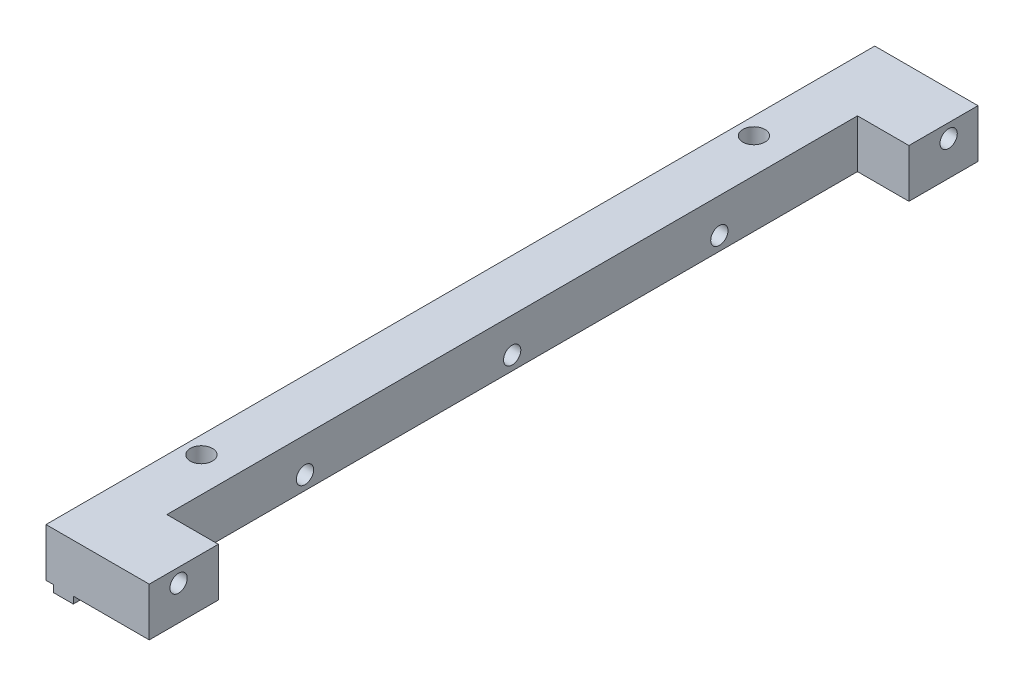
ISO-10303-21;
HEADER;
FILE_DESCRIPTION(('STEP AP214'),'2;1');
FILE_NAME('part.step','',(''),(''),'','','');
FILE_SCHEMA(('AUTOMOTIVE_DESIGN { 1 0 10303 214 1 1 1 1 }'));
ENDSEC;
DATA;
#1=APPLICATION_CONTEXT('core data for automotive mechanical design processes');
#2=APPLICATION_PROTOCOL_DEFINITION('international standard','automotive_design',2000,#1);
#3=PRODUCT_CONTEXT('',#1,'mechanical');
#4=PRODUCT('Part','Part','',(#3));
#5=PRODUCT_RELATED_PRODUCT_CATEGORY('part','',(#4));
#6=PRODUCT_DEFINITION_FORMATION('','',#4);
#7=PRODUCT_DEFINITION_CONTEXT('part definition',#1,'design');
#8=PRODUCT_DEFINITION('design','',#6,#7);
#9=PRODUCT_DEFINITION_SHAPE('','',#8);
#10=(LENGTH_UNIT() NAMED_UNIT(*) SI_UNIT(.MILLI.,.METRE.));
#11=(NAMED_UNIT(*) PLANE_ANGLE_UNIT() SI_UNIT($,.RADIAN.));
#12=(NAMED_UNIT(*) SI_UNIT($,.STERADIAN.) SOLID_ANGLE_UNIT());
#13=UNCERTAINTY_MEASURE_WITH_UNIT(LENGTH_MEASURE(1.E-05),#10,'distance_accuracy_value','');
#14=(GEOMETRIC_REPRESENTATION_CONTEXT(3) GLOBAL_UNCERTAINTY_ASSIGNED_CONTEXT((#13)) GLOBAL_UNIT_ASSIGNED_CONTEXT((#10,
#11,#12)) REPRESENTATION_CONTEXT('',''));
#15=CARTESIAN_POINT('',(0.,0.,0.));
#16=DIRECTION('',(0.,0.,1.));
#17=DIRECTION('',(1.,0.,0.));
#18=AXIS2_PLACEMENT_3D('',#15,#16,#17);
#19=CARTESIAN_POINT('',(14.95,7.,120.));
#20=DIRECTION('',(-1.,0.,0.));
#21=DIRECTION('',(0.,0.,1.));
#22=AXIS2_PLACEMENT_3D('',#19,#20,#21);
#23=PLANE('',#22);
#24=CARTESIAN_POINT('',(14.95,5.,4.25));
#25=DIRECTION('',(1.,0.,0.));
#26=DIRECTION('',(0.,0.,-1.));
#27=AXIS2_PLACEMENT_3D('',#24,#25,#26);
#28=CIRCLE('',#27,1.25);
#29=CARTESIAN_POINT('',(14.95,5.,3.));
#30=VERTEX_POINT('',#29);
#31=EDGE_CURVE('E249',#30,#30,#28,.T.);
#32=ORIENTED_EDGE('',*,*,#31,.F.);
#33=EDGE_LOOP('',(#32));
#34=FACE_BOUND('',#33,.T.);
#35=DIRECTION('',(0.,0.,-1.));
#36=VECTOR('',#35,1.);
#37=CARTESIAN_POINT('',(14.95,7.,120.));
#38=LINE('',#37,#36);
#39=CARTESIAN_POINT('',(14.95,7.,10.));
#40=VERTEX_POINT('',#39);
#41=CARTESIAN_POINT('',(14.95,7.,0.));
#42=VERTEX_POINT('',#41);
#43=EDGE_CURVE('E300',#40,#42,#38,.T.);
#44=ORIENTED_EDGE('',*,*,#43,.F.);
#45=DIRECTION('',(0.,1.,0.));
#46=VECTOR('',#45,1.);
#47=CARTESIAN_POINT('',(14.95,0.,9.99999999999999));
#48=LINE('',#47,#46);
#49=CARTESIAN_POINT('',(14.95,0.,9.99999999999999));
#50=VERTEX_POINT('',#49);
#51=EDGE_CURVE('E327',#50,#40,#48,.T.);
#52=ORIENTED_EDGE('',*,*,#51,.F.);
#53=DIRECTION('',(0.,0.,-1.));
#54=VECTOR('',#53,1.);
#55=CARTESIAN_POINT('',(14.95,0.,120.));
#56=LINE('',#55,#54);
#57=CARTESIAN_POINT('',(14.95,0.,0.));
#58=VERTEX_POINT('',#57);
#59=EDGE_CURVE('E302',#50,#58,#56,.T.);
#60=ORIENTED_EDGE('',*,*,#59,.T.);
#61=DIRECTION('',(0.,1.,0.));
#62=VECTOR('',#61,1.);
#63=CARTESIAN_POINT('',(14.95,7.,0.));
#64=LINE('',#63,#62);
#65=EDGE_CURVE('E294',#58,#42,#64,.T.);
#66=ORIENTED_EDGE('',*,*,#65,.T.);
#67=EDGE_LOOP('',(#44,#52,#60,#66));
#68=FACE_BOUND('',#67,.T.);
#69=ADVANCED_FACE('F33',(#34,#68),#23,.F.);
#70=CARTESIAN_POINT('',(3.95,0.,120.));
#71=DIRECTION('',(-1.,0.,0.));
#72=DIRECTION('',(0.,0.,1.));
#73=AXIS2_PLACEMENT_3D('',#70,#71,#72);
#74=PLANE('',#73);
#75=DIRECTION('',(0.,0.,-1.));
#76=VECTOR('',#75,1.);
#77=CARTESIAN_POINT('',(3.95,0.,120.));
#78=LINE('',#77,#76);
#79=CARTESIAN_POINT('',(3.95,0.,19.3236125370766));
#80=VERTEX_POINT('',#79);
#81=CARTESIAN_POINT('',(3.95,0.,0.));
#82=VERTEX_POINT('',#81);
#83=EDGE_CURVE('E306',#80,#82,#78,.T.);
#84=ORIENTED_EDGE('',*,*,#83,.F.);
#85=DIRECTION('',(0.,-1.,0.));
#86=VECTOR('',#85,1.);
#87=CARTESIAN_POINT('',(3.95,7.,19.3236125370766));
#88=LINE('',#87,#86);
#89=CARTESIAN_POINT('',(3.95,-1.,19.3236125370766));
#90=VERTEX_POINT('',#89);
#91=EDGE_CURVE('E58',#80,#90,#88,.T.);
#92=ORIENTED_EDGE('',*,*,#91,.T.);
#93=DIRECTION('',(0.,0.,-1.));
#94=VECTOR('',#93,1.);
#95=CARTESIAN_POINT('',(3.95,-1.,120.));
#96=LINE('',#95,#94);
#97=CARTESIAN_POINT('',(3.95,-1.,0.));
#98=VERTEX_POINT('',#97);
#99=EDGE_CURVE('E310',#90,#98,#96,.T.);
#100=ORIENTED_EDGE('',*,*,#99,.T.);
#101=DIRECTION('',(0.,1.,0.));
#102=VECTOR('',#101,1.);
#103=CARTESIAN_POINT('',(3.95,0.,0.));
#104=LINE('',#103,#102);
#105=EDGE_CURVE('E288',#98,#82,#104,.T.);
#106=ORIENTED_EDGE('',*,*,#105,.T.);
#107=EDGE_LOOP('',(#84,#92,#100,#106));
#108=FACE_BOUND('',#107,.T.);
#109=ADVANCED_FACE('F423',(#108),#74,.F.);
#110=CARTESIAN_POINT('',(1.05,-1.,120.));
#111=DIRECTION('',(1.,0.,0.));
#112=DIRECTION('',(0.,0.,-1.));
#113=AXIS2_PLACEMENT_3D('',#110,#111,#112);
#114=PLANE('',#113);
#115=DIRECTION('',(0.,0.,-1.));
#116=VECTOR('',#115,1.);
#117=CARTESIAN_POINT('',(1.05,0.,120.));
#118=LINE('',#117,#116);
#119=CARTESIAN_POINT('',(1.05,0.,99.3236125370766));
#120=VERTEX_POINT('',#119);
#121=CARTESIAN_POINT('',(1.05,0.,20.6763874629234));
#122=VERTEX_POINT('',#121);
#123=EDGE_CURVE('E323',#120,#122,#118,.T.);
#124=ORIENTED_EDGE('',*,*,#123,.T.);
#125=DIRECTION('',(0.,-1.,0.));
#126=VECTOR('',#125,1.);
#127=CARTESIAN_POINT('',(1.05,7.,20.6763874629234));
#128=LINE('',#127,#126);
#129=CARTESIAN_POINT('',(1.05,-1.,20.6763874629234));
#130=VERTEX_POINT('',#129);
#131=EDGE_CURVE('E218',#122,#130,#128,.T.);
#132=ORIENTED_EDGE('',*,*,#131,.T.);
#133=DIRECTION('',(0.,0.,-1.));
#134=VECTOR('',#133,1.);
#135=CARTESIAN_POINT('',(1.05,-1.,120.));
#136=LINE('',#135,#134);
#137=CARTESIAN_POINT('',(1.05,-1.,99.3236125370766));
#138=VERTEX_POINT('',#137);
#139=EDGE_CURVE('E321',#138,#130,#136,.T.);
#140=ORIENTED_EDGE('',*,*,#139,.F.);
#141=DIRECTION('',(0.,-1.,0.));
#142=VECTOR('',#141,1.);
#143=CARTESIAN_POINT('',(1.05,7.,99.3236125370766));
#144=LINE('',#143,#142);
#145=EDGE_CURVE('E236',#138,#120,#144,.F.);
#146=ORIENTED_EDGE('',*,*,#145,.T.);
#147=EDGE_LOOP('',(#124,#132,#140,#146));
#148=FACE_BOUND('',#147,.T.);
#149=ADVANCED_FACE('F418',(#148),#114,.F.);
#150=CARTESIAN_POINT('',(3.95,-1.,120.));
#151=DIRECTION('',(0.,1.,0.));
#152=DIRECTION('',(-1.,0.,0.));
#153=AXIS2_PLACEMENT_3D('',#150,#151,#152);
#154=PLANE('',#153);
#155=ORIENTED_EDGE('',*,*,#139,.T.);
#156=CARTESIAN_POINT('',(2.5,-1.,20.));
#157=DIRECTION('',(0.,-1.,0.));
#158=DIRECTION('',(0.,0.,-1.));
#159=AXIS2_PLACEMENT_3D('',#156,#157,#158);
#160=CIRCLE('',#159,1.6);
#161=CARTESIAN_POINT('',(3.95,-1.,20.6763874629234));
#162=VERTEX_POINT('',#161);
#163=EDGE_CURVE('E204',#162,#130,#160,.T.);
#164=ORIENTED_EDGE('',*,*,#163,.F.);
#165=CARTESIAN_POINT('',(3.95,-1.,99.3236125370766));
#166=VERTEX_POINT('',#165);
#167=EDGE_CURVE('E316',#166,#162,#96,.T.);
#168=ORIENTED_EDGE('',*,*,#167,.F.);
#169=CARTESIAN_POINT('',(2.5,-1.,100.));
#170=DIRECTION('',(0.,-1.,0.));
#171=DIRECTION('',(0.,0.,-1.));
#172=AXIS2_PLACEMENT_3D('',#169,#170,#171);
#173=CIRCLE('',#172,1.6);
#174=EDGE_CURVE('E221',#138,#166,#173,.T.);
#175=ORIENTED_EDGE('',*,*,#174,.F.);
#176=EDGE_LOOP('',(#155,#164,#168,#175));
#177=FACE_BOUND('',#176,.T.);
#178=ADVANCED_FACE('F415',(#177),#154,.F.);
#179=CARTESIAN_POINT('',(1.05,0.,120.));
#180=VERTEX_POINT('',#179);
#181=CARTESIAN_POINT('',(1.05,0.,100.676387462923));
#182=VERTEX_POINT('',#181);
#183=EDGE_CURVE('E42',#180,#182,#118,.T.);
#184=ORIENTED_EDGE('',*,*,#183,.T.);
#185=DIRECTION('',(0.,-1.,0.));
#186=VECTOR('',#185,1.);
#187=CARTESIAN_POINT('',(1.05,7.,100.676387462923));
#188=LINE('',#187,#186);
#189=CARTESIAN_POINT('',(1.05,-1.,100.676387462923));
#190=VERTEX_POINT('',#189);
#191=EDGE_CURVE('E242',#182,#190,#188,.T.);
#192=ORIENTED_EDGE('',*,*,#191,.T.);
#193=CARTESIAN_POINT('',(1.05,-1.,120.));
#194=VERTEX_POINT('',#193);
#195=EDGE_CURVE('E317',#194,#190,#136,.T.);
#196=ORIENTED_EDGE('',*,*,#195,.F.);
#197=DIRECTION('',(0.,-1.,0.));
#198=VECTOR('',#197,1.);
#199=CARTESIAN_POINT('',(1.05,-1.,120.));
#200=LINE('',#199,#198);
#201=EDGE_CURVE('E264',#180,#194,#200,.T.);
#202=ORIENTED_EDGE('',*,*,#201,.F.);
#203=EDGE_LOOP('',(#184,#192,#196,#202));
#204=FACE_BOUND('',#203,.T.);
#205=ADVANCED_FACE('F394',(#204),#114,.F.);
#206=ORIENTED_EDGE('',*,*,#195,.T.);
#207=CARTESIAN_POINT('',(3.95,-1.,100.676387462923));
#208=VERTEX_POINT('',#207);
#209=EDGE_CURVE('E226',#208,#190,#173,.T.);
#210=ORIENTED_EDGE('',*,*,#209,.F.);
#211=CARTESIAN_POINT('',(3.95,-1.,120.));
#212=VERTEX_POINT('',#211);
#213=EDGE_CURVE('E312',#212,#208,#96,.T.);
#214=ORIENTED_EDGE('',*,*,#213,.F.);
#215=DIRECTION('',(1.,0.,0.));
#216=VECTOR('',#215,1.);
#217=CARTESIAN_POINT('',(3.95,-1.,120.));
#218=LINE('',#217,#216);
#219=EDGE_CURVE('E266',#194,#212,#218,.T.);
#220=ORIENTED_EDGE('',*,*,#219,.F.);
#221=EDGE_LOOP('',(#206,#210,#214,#220));
#222=FACE_BOUND('',#221,.T.);
#223=ADVANCED_FACE('F389',(#222),#154,.F.);
#224=ORIENTED_EDGE('',*,*,#167,.T.);
#225=DIRECTION('',(0.,-1.,0.));
#226=VECTOR('',#225,1.);
#227=CARTESIAN_POINT('',(3.95,7.,20.6763874629234));
#228=LINE('',#227,#226);
#229=CARTESIAN_POINT('',(3.95,0.,20.6763874629234));
#230=VERTEX_POINT('',#229);
#231=EDGE_CURVE('E208',#162,#230,#228,.F.);
#232=ORIENTED_EDGE('',*,*,#231,.T.);
#233=CARTESIAN_POINT('',(3.95,0.,99.3236125370766));
#234=VERTEX_POINT('',#233);
#235=EDGE_CURVE('E311',#234,#230,#78,.T.);
#236=ORIENTED_EDGE('',*,*,#235,.F.);
#237=DIRECTION('',(0.,-1.,0.));
#238=VECTOR('',#237,1.);
#239=CARTESIAN_POINT('',(3.95,7.,99.3236125370766));
#240=LINE('',#239,#238);
#241=EDGE_CURVE('E233',#234,#166,#240,.T.);
#242=ORIENTED_EDGE('',*,*,#241,.T.);
#243=EDGE_LOOP('',(#224,#232,#236,#242));
#244=FACE_BOUND('',#243,.T.);
#245=ADVANCED_FACE('F421',(#244),#74,.F.);
#246=CARTESIAN_POINT('',(0.,0.,120.));
#247=DIRECTION('',(1.,0.,0.));
#248=DIRECTION('',(0.,0.,-1.));
#249=AXIS2_PLACEMENT_3D('',#246,#247,#248);
#250=PLANE('',#249);
#251=CARTESIAN_POINT('',(0.,2.00000000000001,30.));
#252=DIRECTION('',(-1.,0.,0.));
#253=DIRECTION('',(0.,0.,1.));
#254=AXIS2_PLACEMENT_3D('',#251,#252,#253);
#255=CIRCLE('',#254,1.25);
#256=CARTESIAN_POINT('',(0.,2.00000000000001,31.25));
#257=VERTEX_POINT('',#256);
#258=EDGE_CURVE('E331',#257,#257,#255,.T.);
#259=ORIENTED_EDGE('',*,*,#258,.F.);
#260=EDGE_LOOP('',(#259));
#261=FACE_BOUND('',#260,.T.);
#262=CARTESIAN_POINT('',(0.,2.00000000000001,90.));
#263=DIRECTION('',(-1.,0.,0.));
#264=DIRECTION('',(0.,0.,1.));
#265=AXIS2_PLACEMENT_3D('',#262,#263,#264);
#266=CIRCLE('',#265,1.25);
#267=CARTESIAN_POINT('',(0.,2.00000000000001,91.25));
#268=VERTEX_POINT('',#267);
#269=EDGE_CURVE('E336',#268,#268,#266,.T.);
#270=ORIENTED_EDGE('',*,*,#269,.F.);
#271=EDGE_LOOP('',(#270));
#272=FACE_BOUND('',#271,.T.);
#273=CARTESIAN_POINT('',(0.,2.00000000000001,60.));
#274=DIRECTION('',(-1.,0.,0.));
#275=DIRECTION('',(0.,0.,1.));
#276=AXIS2_PLACEMENT_3D('',#273,#274,#275);
#277=CIRCLE('',#276,1.25);
#278=CARTESIAN_POINT('',(0.,2.00000000000001,61.25));
#279=VERTEX_POINT('',#278);
#280=EDGE_CURVE('E328',#279,#279,#277,.T.);
#281=ORIENTED_EDGE('',*,*,#280,.F.);
#282=EDGE_LOOP('',(#281));
#283=FACE_BOUND('',#282,.T.);
#284=CARTESIAN_POINT('',(0.,5.,115.75));
#285=DIRECTION('',(1.,0.,0.));
#286=DIRECTION('',(0.,0.,-1.));
#287=AXIS2_PLACEMENT_3D('',#284,#285,#286);
#288=CIRCLE('',#287,1.25);
#289=CARTESIAN_POINT('',(0.,5.,114.5));
#290=VERTEX_POINT('',#289);
#291=EDGE_CURVE('E246',#290,#290,#288,.T.);
#292=ORIENTED_EDGE('',*,*,#291,.T.);
#293=EDGE_LOOP('',(#292));
#294=FACE_BOUND('',#293,.T.);
#295=CARTESIAN_POINT('',(0.,5.,4.25));
#296=DIRECTION('',(1.,0.,0.));
#297=DIRECTION('',(0.,0.,-1.));
#298=AXIS2_PLACEMENT_3D('',#295,#296,#297);
#299=CIRCLE('',#298,1.25);
#300=CARTESIAN_POINT('',(0.,5.,3.));
#301=VERTEX_POINT('',#300);
#302=EDGE_CURVE('E252',#301,#301,#299,.T.);
#303=ORIENTED_EDGE('',*,*,#302,.T.);
#304=EDGE_LOOP('',(#303));
#305=FACE_BOUND('',#304,.T.);
#306=DIRECTION('',(0.,-1.,0.));
#307=VECTOR('',#306,1.);
#308=CARTESIAN_POINT('',(0.,0.,0.));
#309=LINE('',#308,#307);
#310=CARTESIAN_POINT('',(0.,7.,0.));
#311=VERTEX_POINT('',#310);
#312=CARTESIAN_POINT('',(0.,0.,0.));
#313=VERTEX_POINT('',#312);
#314=EDGE_CURVE('E255',#311,#313,#309,.T.);
#315=ORIENTED_EDGE('',*,*,#314,.T.);
#316=DIRECTION('',(0.,0.,-1.));
#317=VECTOR('',#316,1.);
#318=CARTESIAN_POINT('',(0.,0.,120.));
#319=LINE('',#318,#317);
#320=CARTESIAN_POINT('',(0.,0.,120.));
#321=VERTEX_POINT('',#320);
#322=EDGE_CURVE('E11',#321,#313,#319,.T.);
#323=ORIENTED_EDGE('',*,*,#322,.F.);
#324=DIRECTION('',(0.,-1.,0.));
#325=VECTOR('',#324,1.);
#326=CARTESIAN_POINT('',(0.,0.,120.));
#327=LINE('',#326,#325);
#328=CARTESIAN_POINT('',(0.,7.,120.));
#329=VERTEX_POINT('',#328);
#330=EDGE_CURVE('E258',#329,#321,#327,.T.);
#331=ORIENTED_EDGE('',*,*,#330,.F.);
#332=DIRECTION('',(0.,0.,-1.));
#333=VECTOR('',#332,1.);
#334=CARTESIAN_POINT('',(0.,7.,120.));
#335=LINE('',#334,#333);
#336=EDGE_CURVE('E276',#329,#311,#335,.T.);
#337=ORIENTED_EDGE('',*,*,#336,.T.);
#338=EDGE_LOOP('',(#315,#323,#331,#337));
#339=FACE_BOUND('',#338,.T.);
#340=ADVANCED_FACE('F35',(#261,#272,#283,#294,#305,#339),#250,.F.);
#341=CARTESIAN_POINT('',(1.05,0.,120.));
#342=DIRECTION('',(0.,1.,0.));
#343=DIRECTION('',(-1.,0.,0.));
#344=AXIS2_PLACEMENT_3D('',#341,#342,#343);
#345=PLANE('',#344);
#346=CARTESIAN_POINT('',(1.05,0.,19.3236125370766));
#347=VERTEX_POINT('',#346);
#348=CARTESIAN_POINT('',(1.05,0.,0.));
#349=VERTEX_POINT('',#348);
#350=EDGE_CURVE('E320',#347,#349,#118,.T.);
#351=ORIENTED_EDGE('',*,*,#350,.F.);
#352=CARTESIAN_POINT('',(2.5,0.,20.));
#353=DIRECTION('',(0.,1.,0.));
#354=DIRECTION('',(-1.,0.,0.));
#355=AXIS2_PLACEMENT_3D('',#352,#353,#354);
#356=CIRCLE('',#355,1.6);
#357=EDGE_CURVE('E215',#347,#122,#356,.T.);
#358=ORIENTED_EDGE('',*,*,#357,.T.);
#359=ORIENTED_EDGE('',*,*,#123,.F.);
#360=CARTESIAN_POINT('',(2.5,0.,100.));
#361=DIRECTION('',(0.,1.,0.));
#362=DIRECTION('',(-1.,0.,0.));
#363=AXIS2_PLACEMENT_3D('',#360,#361,#362);
#364=CIRCLE('',#363,1.6);
#365=EDGE_CURVE('E239',#120,#182,#364,.T.);
#366=ORIENTED_EDGE('',*,*,#365,.T.);
#367=ORIENTED_EDGE('',*,*,#183,.F.);
#368=DIRECTION('',(1.,0.,0.));
#369=VECTOR('',#368,1.);
#370=CARTESIAN_POINT('',(1.05,0.,120.));
#371=LINE('',#370,#369);
#372=EDGE_CURVE('E261',#321,#180,#371,.T.);
#373=ORIENTED_EDGE('',*,*,#372,.F.);
#374=ORIENTED_EDGE('',*,*,#322,.T.);
#375=DIRECTION('',(1.,0.,0.));
#376=VECTOR('',#375,1.);
#377=CARTESIAN_POINT('',(1.05,0.,0.));
#378=LINE('',#377,#376);
#379=EDGE_CURVE('E279',#313,#349,#378,.T.);
#380=ORIENTED_EDGE('',*,*,#379,.T.);
#381=EDGE_LOOP('',(#351,#358,#359,#366,#367,#373,#374,#380));
#382=FACE_BOUND('',#381,.T.);
#383=ADVANCED_FACE('F398',(#382),#345,.F.);
#384=CARTESIAN_POINT('',(1.05,-1.,19.3236125370766));
#385=VERTEX_POINT('',#384);
#386=CARTESIAN_POINT('',(1.05,-1.,0.));
#387=VERTEX_POINT('',#386);
#388=EDGE_CURVE('E315',#385,#387,#136,.T.);
#389=ORIENTED_EDGE('',*,*,#388,.F.);
#390=DIRECTION('',(0.,-1.,0.));
#391=VECTOR('',#390,1.);
#392=CARTESIAN_POINT('',(1.05,7.,19.3236125370766));
#393=LINE('',#392,#391);
#394=EDGE_CURVE('E212',#385,#347,#393,.F.);
#395=ORIENTED_EDGE('',*,*,#394,.T.);
#396=ORIENTED_EDGE('',*,*,#350,.T.);
#397=DIRECTION('',(0.,-1.,0.));
#398=VECTOR('',#397,1.);
#399=CARTESIAN_POINT('',(1.05,-1.,0.));
#400=LINE('',#399,#398);
#401=EDGE_CURVE('E282',#349,#387,#400,.T.);
#402=ORIENTED_EDGE('',*,*,#401,.T.);
#403=EDGE_LOOP('',(#389,#395,#396,#402));
#404=FACE_BOUND('',#403,.T.);
#405=ADVANCED_FACE('F403',(#404),#114,.F.);
#406=ORIENTED_EDGE('',*,*,#99,.F.);
#407=EDGE_CURVE('E205',#385,#90,#160,.T.);
#408=ORIENTED_EDGE('',*,*,#407,.F.);
#409=ORIENTED_EDGE('',*,*,#388,.T.);
#410=DIRECTION('',(1.,0.,0.));
#411=VECTOR('',#410,1.);
#412=CARTESIAN_POINT('',(3.95,-1.,0.));
#413=LINE('',#412,#411);
#414=EDGE_CURVE('E285',#387,#98,#413,.T.);
#415=ORIENTED_EDGE('',*,*,#414,.T.);
#416=EDGE_LOOP('',(#406,#408,#409,#415));
#417=FACE_BOUND('',#416,.T.);
#418=ADVANCED_FACE('F408',(#417),#154,.F.);
#419=ORIENTED_EDGE('',*,*,#213,.T.);
#420=DIRECTION('',(0.,-1.,0.));
#421=VECTOR('',#420,1.);
#422=CARTESIAN_POINT('',(3.95,7.,100.676387462923));
#423=LINE('',#422,#421);
#424=CARTESIAN_POINT('',(3.95,0.,100.676387462923));
#425=VERTEX_POINT('',#424);
#426=EDGE_CURVE('E230',#208,#425,#423,.F.);
#427=ORIENTED_EDGE('',*,*,#426,.T.);
#428=CARTESIAN_POINT('',(3.95,0.,120.));
#429=VERTEX_POINT('',#428);
#430=EDGE_CURVE('E307',#429,#425,#78,.T.);
#431=ORIENTED_EDGE('',*,*,#430,.F.);
#432=DIRECTION('',(0.,1.,0.));
#433=VECTOR('',#432,1.);
#434=CARTESIAN_POINT('',(3.95,0.,120.));
#435=LINE('',#434,#433);
#436=EDGE_CURVE('E268',#212,#429,#435,.T.);
#437=ORIENTED_EDGE('',*,*,#436,.F.);
#438=EDGE_LOOP('',(#419,#427,#431,#437));
#439=FACE_BOUND('',#438,.T.);
#440=ADVANCED_FACE('F383',(#439),#74,.F.);
#441=CARTESIAN_POINT('',(14.95,0.,120.));
#442=DIRECTION('',(0.,1.,0.));
#443=DIRECTION('',(-1.,0.,0.));
#444=AXIS2_PLACEMENT_3D('',#441,#442,#443);
#445=PLANE('',#444);
#446=ORIENTED_EDGE('',*,*,#59,.F.);
#447=DIRECTION('',(1.,0.,0.));
#448=VECTOR('',#447,1.);
#449=CARTESIAN_POINT('',(7.5,0.,9.99999999999999));
#450=LINE('',#449,#448);
#451=CARTESIAN_POINT('',(7.5,0.,9.99999999999999));
#452=VERTEX_POINT('',#451);
#453=EDGE_CURVE('E195',#452,#50,#450,.T.);
#454=ORIENTED_EDGE('',*,*,#453,.F.);
#455=DIRECTION('',(0.,0.,-1.));
#456=VECTOR('',#455,1.);
#457=CARTESIAN_POINT('',(7.5,0.,9.99999999999999));
#458=LINE('',#457,#456);
#459=CARTESIAN_POINT('',(7.5,0.,110.));
#460=VERTEX_POINT('',#459);
#461=EDGE_CURVE('E180',#460,#452,#458,.T.);
#462=ORIENTED_EDGE('',*,*,#461,.F.);
#463=DIRECTION('',(1.,0.,0.));
#464=VECTOR('',#463,1.);
#465=CARTESIAN_POINT('',(7.5,0.,110.));
#466=LINE('',#465,#464);
#467=CARTESIAN_POINT('',(14.95,0.,110.));
#468=VERTEX_POINT('',#467);
#469=EDGE_CURVE('E178',#460,#468,#466,.T.);
#470=ORIENTED_EDGE('',*,*,#469,.T.);
#471=CARTESIAN_POINT('',(14.95,0.,120.));
#472=VERTEX_POINT('',#471);
#473=EDGE_CURVE('E303',#472,#468,#56,.T.);
#474=ORIENTED_EDGE('',*,*,#473,.F.);
#475=DIRECTION('',(1.,0.,0.));
#476=VECTOR('',#475,1.);
#477=CARTESIAN_POINT('',(14.95,0.,120.));
#478=LINE('',#477,#476);
#479=EDGE_CURVE('E270',#429,#472,#478,.T.);
#480=ORIENTED_EDGE('',*,*,#479,.F.);
#481=ORIENTED_EDGE('',*,*,#430,.T.);
#482=CARTESIAN_POINT('',(2.5,0.,100.));
#483=DIRECTION('',(0.,1.,0.));
#484=DIRECTION('',(-1.,0.,0.));
#485=AXIS2_PLACEMENT_3D('',#482,#483,#484);
#486=CIRCLE('',#485,1.6);
#487=EDGE_CURVE('E225',#425,#234,#486,.T.);
#488=ORIENTED_EDGE('',*,*,#487,.T.);
#489=ORIENTED_EDGE('',*,*,#235,.T.);
#490=CARTESIAN_POINT('',(2.5,0.,20.));
#491=DIRECTION('',(0.,1.,0.));
#492=DIRECTION('',(-1.,0.,0.));
#493=AXIS2_PLACEMENT_3D('',#490,#491,#492);
#494=CIRCLE('',#493,1.6);
#495=EDGE_CURVE('E203',#230,#80,#494,.T.);
#496=ORIENTED_EDGE('',*,*,#495,.T.);
#497=ORIENTED_EDGE('',*,*,#83,.T.);
#498=DIRECTION('',(1.,0.,0.));
#499=VECTOR('',#498,1.);
#500=CARTESIAN_POINT('',(14.95,0.,0.));
#501=LINE('',#500,#499);
#502=EDGE_CURVE('E291',#82,#58,#501,.T.);
#503=ORIENTED_EDGE('',*,*,#502,.T.);
#504=EDGE_LOOP('',(#446,#454,#462,#470,#474,#480,#481,#488,#489,#496,#497,#503));
#505=FACE_BOUND('',#504,.T.);
#506=ADVANCED_FACE('F357',(#505),#445,.F.);
#507=CARTESIAN_POINT('',(14.95,5.,115.75));
#508=DIRECTION('',(1.,0.,0.));
#509=DIRECTION('',(0.,0.,-1.));
#510=AXIS2_PLACEMENT_3D('',#507,#508,#509);
#511=CIRCLE('',#510,1.25);
#512=CARTESIAN_POINT('',(14.95,5.,114.5));
#513=VERTEX_POINT('',#512);
#514=EDGE_CURVE('E245',#513,#513,#511,.T.);
#515=ORIENTED_EDGE('',*,*,#514,.F.);
#516=EDGE_LOOP('',(#515));
#517=FACE_BOUND('',#516,.T.);
#518=ORIENTED_EDGE('',*,*,#473,.T.);
#519=DIRECTION('',(0.,-1.,0.));
#520=VECTOR('',#519,1.);
#521=CARTESIAN_POINT('',(14.95,0.,110.));
#522=LINE('',#521,#520);
#523=CARTESIAN_POINT('',(14.95,7.,110.));
#524=VERTEX_POINT('',#523);
#525=EDGE_CURVE('E345',#524,#468,#522,.T.);
#526=ORIENTED_EDGE('',*,*,#525,.F.);
#527=CARTESIAN_POINT('',(14.95,7.,120.));
#528=VERTEX_POINT('',#527);
#529=EDGE_CURVE('E192',#528,#524,#38,.T.);
#530=ORIENTED_EDGE('',*,*,#529,.F.);
#531=DIRECTION('',(0.,1.,0.));
#532=VECTOR('',#531,1.);
#533=CARTESIAN_POINT('',(14.95,7.,120.));
#534=LINE('',#533,#532);
#535=EDGE_CURVE('E272',#472,#528,#534,.T.);
#536=ORIENTED_EDGE('',*,*,#535,.F.);
#537=EDGE_LOOP('',(#518,#526,#530,#536));
#538=FACE_BOUND('',#537,.T.);
#539=ADVANCED_FACE('F377',(#517,#538),#23,.F.);
#540=CARTESIAN_POINT('',(0.,7.,120.));
#541=DIRECTION('',(0.,-1.,0.));
#542=DIRECTION('',(0.,0.,-1.));
#543=AXIS2_PLACEMENT_3D('',#540,#541,#542);
#544=PLANE('',#543);
#545=CARTESIAN_POINT('',(2.5,7.,20.));
#546=DIRECTION('',(0.,-1.,0.));
#547=DIRECTION('',(0.,0.,-1.));
#548=AXIS2_PLACEMENT_3D('',#545,#546,#547);
#549=CIRCLE('',#548,1.6);
#550=CARTESIAN_POINT('',(2.5,7.,18.4));
#551=VERTEX_POINT('',#550);
#552=EDGE_CURVE('E200',#551,#551,#549,.T.);
#553=ORIENTED_EDGE('',*,*,#552,.T.);
#554=EDGE_LOOP('',(#553));
#555=FACE_BOUND('',#554,.T.);
#556=CARTESIAN_POINT('',(2.5,7.,100.));
#557=DIRECTION('',(0.,-1.,0.));
#558=DIRECTION('',(0.,0.,-1.));
#559=AXIS2_PLACEMENT_3D('',#556,#557,#558);
#560=CIRCLE('',#559,1.6);
#561=CARTESIAN_POINT('',(2.5,7.,98.4));
#562=VERTEX_POINT('',#561);
#563=EDGE_CURVE('E222',#562,#562,#560,.T.);
#564=ORIENTED_EDGE('',*,*,#563,.T.);
#565=EDGE_LOOP('',(#564));
#566=FACE_BOUND('',#565,.T.);
#567=DIRECTION('',(0.,0.,1.));
#568=VECTOR('',#567,1.);
#569=CARTESIAN_POINT('',(7.5,7.,10.));
#570=LINE('',#569,#568);
#571=CARTESIAN_POINT('',(7.5,7.,9.99999999999999));
#572=VERTEX_POINT('',#571);
#573=CARTESIAN_POINT('',(7.5,7.,110.));
#574=VERTEX_POINT('',#573);
#575=EDGE_CURVE('E181',#572,#574,#570,.T.);
#576=ORIENTED_EDGE('',*,*,#575,.F.);
#577=DIRECTION('',(1.,0.,0.));
#578=VECTOR('',#577,1.);
#579=CARTESIAN_POINT('',(7.5,7.,10.));
#580=LINE('',#579,#578);
#581=EDGE_CURVE('E193',#572,#40,#580,.T.);
#582=ORIENTED_EDGE('',*,*,#581,.T.);
#583=ORIENTED_EDGE('',*,*,#43,.T.);
#584=DIRECTION('',(-1.,0.,0.));
#585=VECTOR('',#584,1.);
#586=CARTESIAN_POINT('',(0.,7.,0.));
#587=LINE('',#586,#585);
#588=EDGE_CURVE('E262',#42,#311,#587,.T.);
#589=ORIENTED_EDGE('',*,*,#588,.T.);
#590=ORIENTED_EDGE('',*,*,#336,.F.);
#591=DIRECTION('',(-1.,0.,0.));
#592=VECTOR('',#591,1.);
#593=CARTESIAN_POINT('',(0.,7.,120.));
#594=LINE('',#593,#592);
#595=EDGE_CURVE('E274',#528,#329,#594,.T.);
#596=ORIENTED_EDGE('',*,*,#595,.F.);
#597=ORIENTED_EDGE('',*,*,#529,.T.);
#598=DIRECTION('',(1.,0.,0.));
#599=VECTOR('',#598,1.);
#600=CARTESIAN_POINT('',(7.5,7.,110.));
#601=LINE('',#600,#599);
#602=EDGE_CURVE('E175',#574,#524,#601,.T.);
#603=ORIENTED_EDGE('',*,*,#602,.F.);
#604=EDGE_LOOP('',(#576,#582,#583,#589,#590,#596,#597,#603));
#605=FACE_BOUND('',#604,.T.);
#606=ADVANCED_FACE('F189',(#555,#566,#605),#544,.F.);
#607=CARTESIAN_POINT('',(0.,0.,120.));
#608=DIRECTION('',(0.,0.,-1.));
#609=DIRECTION('',(-1.,0.,0.));
#610=AXIS2_PLACEMENT_3D('',#607,#608,#609);
#611=PLANE('',#610);
#612=ORIENTED_EDGE('',*,*,#330,.T.);
#613=ORIENTED_EDGE('',*,*,#372,.T.);
#614=ORIENTED_EDGE('',*,*,#201,.T.);
#615=ORIENTED_EDGE('',*,*,#219,.T.);
#616=ORIENTED_EDGE('',*,*,#436,.T.);
#617=ORIENTED_EDGE('',*,*,#479,.T.);
#618=ORIENTED_EDGE('',*,*,#535,.T.);
#619=ORIENTED_EDGE('',*,*,#595,.T.);
#620=EDGE_LOOP('',(#612,#613,#614,#615,#616,#617,#618,#619));
#621=FACE_BOUND('',#620,.T.);
#622=ADVANCED_FACE('F371',(#621),#611,.F.);
#623=CARTESIAN_POINT('',(0.,0.,0.));
#624=DIRECTION('',(0.,0.,-1.));
#625=DIRECTION('',(-1.,0.,0.));
#626=AXIS2_PLACEMENT_3D('',#623,#624,#625);
#627=PLANE('',#626);
#628=ORIENTED_EDGE('',*,*,#314,.F.);
#629=ORIENTED_EDGE('',*,*,#588,.F.);
#630=ORIENTED_EDGE('',*,*,#65,.F.);
#631=ORIENTED_EDGE('',*,*,#502,.F.);
#632=ORIENTED_EDGE('',*,*,#105,.F.);
#633=ORIENTED_EDGE('',*,*,#414,.F.);
#634=ORIENTED_EDGE('',*,*,#401,.F.);
#635=ORIENTED_EDGE('',*,*,#379,.F.);
#636=EDGE_LOOP('',(#628,#629,#630,#631,#632,#633,#634,#635));
#637=FACE_BOUND('',#636,.T.);
#638=ADVANCED_FACE('F365',(#637),#627,.T.);
#639=CARTESIAN_POINT('',(0.,5.,4.25));
#640=DIRECTION('',(1.,0.,0.));
#641=DIRECTION('',(0.,0.,-1.));
#642=AXIS2_PLACEMENT_3D('',#639,#640,#641);
#643=CYLINDRICAL_SURFACE('',#642,1.25);
#644=ORIENTED_EDGE('',*,*,#302,.F.);
#645=EDGE_LOOP('',(#644));
#646=FACE_BOUND('',#645,.T.);
#647=ORIENTED_EDGE('',*,*,#31,.T.);
#648=EDGE_LOOP('',(#647));
#649=FACE_BOUND('',#648,.T.);
#650=ADVANCED_FACE('F467',(#646,#649),#643,.F.);
#651=CARTESIAN_POINT('',(0.,5.,115.75));
#652=DIRECTION('',(1.,0.,0.));
#653=DIRECTION('',(0.,0.,-1.));
#654=AXIS2_PLACEMENT_3D('',#651,#652,#653);
#655=CYLINDRICAL_SURFACE('',#654,1.25);
#656=ORIENTED_EDGE('',*,*,#291,.F.);
#657=EDGE_LOOP('',(#656));
#658=FACE_BOUND('',#657,.T.);
#659=ORIENTED_EDGE('',*,*,#514,.T.);
#660=EDGE_LOOP('',(#659));
#661=FACE_BOUND('',#660,.T.);
#662=ADVANCED_FACE('F470',(#658,#661),#655,.F.);
#663=CARTESIAN_POINT('',(2.5,7.,100.));
#664=DIRECTION('',(0.,-1.,0.));
#665=DIRECTION('',(0.,0.,-1.));
#666=AXIS2_PLACEMENT_3D('',#663,#664,#665);
#667=CYLINDRICAL_SURFACE('',#666,1.6);
#668=ORIENTED_EDGE('',*,*,#563,.F.);
#669=EDGE_LOOP('',(#668));
#670=FACE_BOUND('',#669,.T.);
#671=ORIENTED_EDGE('',*,*,#365,.F.);
#672=ORIENTED_EDGE('',*,*,#145,.F.);
#673=ORIENTED_EDGE('',*,*,#174,.T.);
#674=ORIENTED_EDGE('',*,*,#241,.F.);
#675=ORIENTED_EDGE('',*,*,#487,.F.);
#676=ORIENTED_EDGE('',*,*,#426,.F.);
#677=ORIENTED_EDGE('',*,*,#209,.T.);
#678=ORIENTED_EDGE('',*,*,#191,.F.);
#679=EDGE_LOOP('',(#671,#672,#673,#674,#675,#676,#677,#678));
#680=FACE_BOUND('',#679,.T.);
#681=ADVANCED_FACE('F387',(#670,#680),#667,.F.);
#682=CARTESIAN_POINT('',(2.5,7.,20.));
#683=DIRECTION('',(0.,-1.,0.));
#684=DIRECTION('',(0.,0.,-1.));
#685=AXIS2_PLACEMENT_3D('',#682,#683,#684);
#686=CYLINDRICAL_SURFACE('',#685,1.6);
#687=ORIENTED_EDGE('',*,*,#552,.F.);
#688=EDGE_LOOP('',(#687));
#689=FACE_BOUND('',#688,.T.);
#690=ORIENTED_EDGE('',*,*,#357,.F.);
#691=ORIENTED_EDGE('',*,*,#394,.F.);
#692=ORIENTED_EDGE('',*,*,#407,.T.);
#693=ORIENTED_EDGE('',*,*,#91,.F.);
#694=ORIENTED_EDGE('',*,*,#495,.F.);
#695=ORIENTED_EDGE('',*,*,#231,.F.);
#696=ORIENTED_EDGE('',*,*,#163,.T.);
#697=ORIENTED_EDGE('',*,*,#131,.F.);
#698=EDGE_LOOP('',(#690,#691,#692,#693,#694,#695,#696,#697));
#699=FACE_BOUND('',#698,.T.);
#700=ADVANCED_FACE('F419',(#689,#699),#686,.F.);
#701=CARTESIAN_POINT('',(7.5,0.,9.99999999999999));
#702=DIRECTION('',(0.,0.,-1.));
#703=DIRECTION('',(0.,1.,0.));
#704=AXIS2_PLACEMENT_3D('',#701,#702,#703);
#705=PLANE('',#704);
#706=ORIENTED_EDGE('',*,*,#51,.T.);
#707=ORIENTED_EDGE('',*,*,#581,.F.);
#708=DIRECTION('',(0.,1.,0.));
#709=VECTOR('',#708,1.);
#710=CARTESIAN_POINT('',(7.5,0.,9.99999999999999));
#711=LINE('',#710,#709);
#712=EDGE_CURVE('E50',#452,#572,#711,.T.);
#713=ORIENTED_EDGE('',*,*,#712,.F.);
#714=ORIENTED_EDGE('',*,*,#453,.T.);
#715=EDGE_LOOP('',(#706,#707,#713,#714));
#716=FACE_BOUND('',#715,.T.);
#717=ADVANCED_FACE('F352',(#716),#705,.F.);
#718=CARTESIAN_POINT('',(7.5,0.,110.));
#719=DIRECTION('',(0.,0.,1.));
#720=DIRECTION('',(1.,0.,0.));
#721=AXIS2_PLACEMENT_3D('',#718,#719,#720);
#722=PLANE('',#721);
#723=ORIENTED_EDGE('',*,*,#525,.T.);
#724=ORIENTED_EDGE('',*,*,#469,.F.);
#725=DIRECTION('',(0.,-1.,0.));
#726=VECTOR('',#725,1.);
#727=CARTESIAN_POINT('',(7.5,0.,110.));
#728=LINE('',#727,#726);
#729=EDGE_CURVE('E172',#574,#460,#728,.T.);
#730=ORIENTED_EDGE('',*,*,#729,.F.);
#731=ORIENTED_EDGE('',*,*,#602,.T.);
#732=EDGE_LOOP('',(#723,#724,#730,#731));
#733=FACE_BOUND('',#732,.T.);
#734=ADVANCED_FACE('F173',(#733),#722,.F.);
#735=CARTESIAN_POINT('',(7.5,0.,0.));
#736=DIRECTION('',(1.,0.,0.));
#737=DIRECTION('',(0.,1.,0.));
#738=AXIS2_PLACEMENT_3D('',#735,#736,#737);
#739=PLANE('',#738);
#740=CARTESIAN_POINT('',(7.5,2.00000000000001,30.));
#741=DIRECTION('',(1.,0.,0.));
#742=DIRECTION('',(0.,1.,0.));
#743=AXIS2_PLACEMENT_3D('',#740,#741,#742);
#744=CIRCLE('',#743,1.25);
#745=CARTESIAN_POINT('',(7.5,3.25000000000001,30.));
#746=VERTEX_POINT('',#745);
#747=EDGE_CURVE('E37',#746,#746,#744,.T.);
#748=ORIENTED_EDGE('',*,*,#747,.F.);
#749=EDGE_LOOP('',(#748));
#750=FACE_BOUND('',#749,.T.);
#751=CARTESIAN_POINT('',(7.5,2.00000000000001,90.));
#752=DIRECTION('',(1.,0.,0.));
#753=DIRECTION('',(0.,1.,0.));
#754=AXIS2_PLACEMENT_3D('',#751,#752,#753);
#755=CIRCLE('',#754,1.25);
#756=CARTESIAN_POINT('',(7.5,3.25000000000001,90.));
#757=VERTEX_POINT('',#756);
#758=EDGE_CURVE('E329',#757,#757,#755,.T.);
#759=ORIENTED_EDGE('',*,*,#758,.F.);
#760=EDGE_LOOP('',(#759));
#761=FACE_BOUND('',#760,.T.);
#762=CARTESIAN_POINT('',(7.5,2.00000000000001,60.));
#763=DIRECTION('',(1.,0.,0.));
#764=DIRECTION('',(0.,1.,0.));
#765=AXIS2_PLACEMENT_3D('',#762,#763,#764);
#766=CIRCLE('',#765,1.25);
#767=CARTESIAN_POINT('',(7.5,3.25000000000001,60.));
#768=VERTEX_POINT('',#767);
#769=EDGE_CURVE('E325',#768,#768,#766,.T.);
#770=ORIENTED_EDGE('',*,*,#769,.F.);
#771=EDGE_LOOP('',(#770));
#772=FACE_BOUND('',#771,.T.);
#773=ORIENTED_EDGE('',*,*,#712,.T.);
#774=ORIENTED_EDGE('',*,*,#575,.T.);
#775=ORIENTED_EDGE('',*,*,#729,.T.);
#776=ORIENTED_EDGE('',*,*,#461,.T.);
#777=EDGE_LOOP('',(#773,#774,#775,#776));
#778=FACE_BOUND('',#777,.T.);
#779=ADVANCED_FACE('F184',(#750,#761,#772,#778),#739,.T.);
#780=CARTESIAN_POINT('',(14.95,2.00000000000001,60.));
#781=DIRECTION('',(-1.,0.,0.));
#782=DIRECTION('',(0.,0.,1.));
#783=AXIS2_PLACEMENT_3D('',#780,#781,#782);
#784=CYLINDRICAL_SURFACE('',#783,1.25);
#785=ORIENTED_EDGE('',*,*,#769,.T.);
#786=EDGE_LOOP('',(#785));
#787=FACE_BOUND('',#786,.T.);
#788=ORIENTED_EDGE('',*,*,#280,.T.);
#789=EDGE_LOOP('',(#788));
#790=FACE_BOUND('',#789,.T.);
#791=ADVANCED_FACE('F622',(#787,#790),#784,.F.);
#792=CARTESIAN_POINT('',(14.95,2.00000000000001,90.));
#793=DIRECTION('',(-1.,0.,0.));
#794=DIRECTION('',(0.,0.,1.));
#795=AXIS2_PLACEMENT_3D('',#792,#793,#794);
#796=CYLINDRICAL_SURFACE('',#795,1.25);
#797=ORIENTED_EDGE('',*,*,#758,.T.);
#798=EDGE_LOOP('',(#797));
#799=FACE_BOUND('',#798,.T.);
#800=ORIENTED_EDGE('',*,*,#269,.T.);
#801=EDGE_LOOP('',(#800));
#802=FACE_BOUND('',#801,.T.);
#803=ADVANCED_FACE('F631',(#799,#802),#796,.F.);
#804=CARTESIAN_POINT('',(14.95,2.00000000000001,30.));
#805=DIRECTION('',(-1.,0.,0.));
#806=DIRECTION('',(0.,0.,1.));
#807=AXIS2_PLACEMENT_3D('',#804,#805,#806);
#808=CYLINDRICAL_SURFACE('',#807,1.25);
#809=ORIENTED_EDGE('',*,*,#747,.T.);
#810=EDGE_LOOP('',(#809));
#811=FACE_BOUND('',#810,.T.);
#812=ORIENTED_EDGE('',*,*,#258,.T.);
#813=EDGE_LOOP('',(#812));
#814=FACE_BOUND('',#813,.T.);
#815=ADVANCED_FACE('F640',(#811,#814),#808,.F.);
#816=CLOSED_SHELL('',(#69,#109,#149,#178,#205,#223,#245,#340,#383,#405,#418,#440,#506,#539,#606,
#622,#638,#650,#662,#681,#700,#717,#734,#779,#791,#803,#815));
#817=MANIFOLD_SOLID_BREP('B2',#816);
#818=ADVANCED_BREP_SHAPE_REPRESENTATION('',(#18,#817),#14);
#819=SHAPE_DEFINITION_REPRESENTATION(#9,#818);
ENDSEC;
END-ISO-10303-21;
